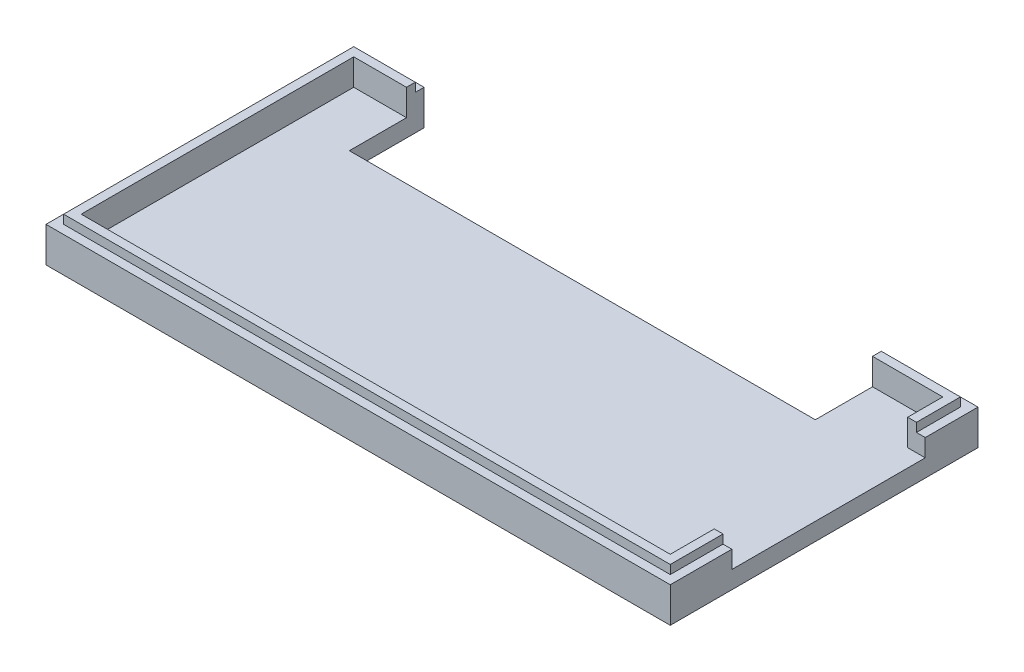
ISO-10303-21;
HEADER;
FILE_DESCRIPTION(('STEP AP214'),'2;1');
FILE_NAME('part.step','',(''),(''),'','','');
FILE_SCHEMA(('AUTOMOTIVE_DESIGN { 1 0 10303 214 1 1 1 1 }'));
ENDSEC;
DATA;
#1=APPLICATION_CONTEXT('core data for automotive mechanical design processes');
#2=APPLICATION_PROTOCOL_DEFINITION('international standard','automotive_design',2000,#1);
#3=PRODUCT_CONTEXT('',#1,'mechanical');
#4=PRODUCT('Part','Part','',(#3));
#5=PRODUCT_RELATED_PRODUCT_CATEGORY('part','',(#4));
#6=PRODUCT_DEFINITION_FORMATION('','',#4);
#7=PRODUCT_DEFINITION_CONTEXT('part definition',#1,'design');
#8=PRODUCT_DEFINITION('design','',#6,#7);
#9=PRODUCT_DEFINITION_SHAPE('','',#8);
#10=(LENGTH_UNIT() NAMED_UNIT(*) SI_UNIT(.MILLI.,.METRE.));
#11=(NAMED_UNIT(*) PLANE_ANGLE_UNIT() SI_UNIT($,.RADIAN.));
#12=(NAMED_UNIT(*) SI_UNIT($,.STERADIAN.) SOLID_ANGLE_UNIT());
#13=UNCERTAINTY_MEASURE_WITH_UNIT(LENGTH_MEASURE(1.E-05),#10,'distance_accuracy_value','');
#14=(GEOMETRIC_REPRESENTATION_CONTEXT(3) GLOBAL_UNCERTAINTY_ASSIGNED_CONTEXT((#13)) GLOBAL_UNIT_ASSIGNED_CONTEXT((#10,
#11,#12)) REPRESENTATION_CONTEXT('',''));
#15=CARTESIAN_POINT('',(0.,0.,0.));
#16=DIRECTION('',(0.,0.,1.));
#17=DIRECTION('',(1.,0.,0.));
#18=AXIS2_PLACEMENT_3D('',#15,#16,#17);
#19=CARTESIAN_POINT('',(0.,4.,0.));
#20=DIRECTION('',(0.,1.,0.));
#21=DIRECTION('',(0.,0.,1.));
#22=AXIS2_PLACEMENT_3D('',#19,#20,#21);
#23=PLANE('',#22);
#24=DIRECTION('',(0.,0.,1.));
#25=VECTOR('',#24,1.);
#26=CARTESIAN_POINT('',(6.00000000000002,4.,0.));
#27=LINE('',#26,#25);
#28=CARTESIAN_POINT('',(5.99999999999999,4.,-33.));
#29=VERTEX_POINT('',#28);
#30=CARTESIAN_POINT('',(5.99999999999999,4.,-32.));
#31=VERTEX_POINT('',#30);
#32=EDGE_CURVE('E347',#29,#31,#27,.T.);
#33=ORIENTED_EDGE('',*,*,#32,.F.);
#34=DIRECTION('',(-1.,0.,0.));
#35=VECTOR('',#34,1.);
#36=CARTESIAN_POINT('',(69.,4.,-33.));
#37=LINE('',#36,#35);
#38=CARTESIAN_POINT('',(-2.,4.,-33.));
#39=VERTEX_POINT('',#38);
#40=EDGE_CURVE('E306',#29,#39,#37,.T.);
#41=ORIENTED_EDGE('',*,*,#40,.T.);
#42=DIRECTION('',(0.,0.,1.));
#43=VECTOR('',#42,1.);
#44=CARTESIAN_POINT('',(-2.,4.,-33.));
#45=LINE('',#44,#43);
#46=CARTESIAN_POINT('',(-2.,4.,2.));
#47=VERTEX_POINT('',#46);
#48=EDGE_CURVE('E308',#39,#47,#45,.T.);
#49=ORIENTED_EDGE('',*,*,#48,.T.);
#50=DIRECTION('',(1.,0.,0.));
#51=VECTOR('',#50,1.);
#52=CARTESIAN_POINT('',(-2.,4.,2.));
#53=LINE('',#52,#51);
#54=CARTESIAN_POINT('',(69.,4.,2.));
#55=VERTEX_POINT('',#54);
#56=EDGE_CURVE('E299',#47,#55,#53,.T.);
#57=ORIENTED_EDGE('',*,*,#56,.T.);
#58=DIRECTION('',(0.,0.,-1.));
#59=VECTOR('',#58,1.);
#60=CARTESIAN_POINT('',(69.,4.,2.));
#61=LINE('',#60,#59);
#62=CARTESIAN_POINT('',(69.,4.,-5.));
#63=VERTEX_POINT('',#62);
#64=EDGE_CURVE('E303',#55,#63,#61,.T.);
#65=ORIENTED_EDGE('',*,*,#64,.T.);
#66=DIRECTION('',(1.,0.,0.));
#67=VECTOR('',#66,1.);
#68=CARTESIAN_POINT('',(0.,4.,-5.));
#69=LINE('',#68,#67);
#70=CARTESIAN_POINT('',(68.,4.,-5.));
#71=VERTEX_POINT('',#70);
#72=EDGE_CURVE('E374',#71,#63,#69,.T.);
#73=ORIENTED_EDGE('',*,*,#72,.F.);
#74=DIRECTION('',(0.,0.,-1.));
#75=VECTOR('',#74,1.);
#76=CARTESIAN_POINT('',(68.,4.,0.999999999999996));
#77=LINE('',#76,#75);
#78=CARTESIAN_POINT('',(68.,4.,0.999999999999996));
#79=VERTEX_POINT('',#78);
#80=EDGE_CURVE('E407',#79,#71,#77,.T.);
#81=ORIENTED_EDGE('',*,*,#80,.F.);
#82=DIRECTION('',(1.,0.,0.));
#83=VECTOR('',#82,1.);
#84=CARTESIAN_POINT('',(-1.,4.,1.));
#85=LINE('',#84,#83);
#86=CARTESIAN_POINT('',(-1.,4.,1.));
#87=VERTEX_POINT('',#86);
#88=EDGE_CURVE('E417',#87,#79,#85,.T.);
#89=ORIENTED_EDGE('',*,*,#88,.F.);
#90=DIRECTION('',(0.,0.,1.));
#91=VECTOR('',#90,1.);
#92=CARTESIAN_POINT('',(-1.,4.,-32.));
#93=LINE('',#92,#91);
#94=CARTESIAN_POINT('',(-1.,4.,-32.));
#95=VERTEX_POINT('',#94);
#96=EDGE_CURVE('E414',#95,#87,#93,.T.);
#97=ORIENTED_EDGE('',*,*,#96,.F.);
#98=DIRECTION('',(-1.,0.,0.));
#99=VECTOR('',#98,1.);
#100=CARTESIAN_POINT('',(68.,4.,-32.));
#101=LINE('',#100,#99);
#102=EDGE_CURVE('E410',#31,#95,#101,.T.);
#103=ORIENTED_EDGE('',*,*,#102,.F.);
#104=EDGE_LOOP('',(#33,#41,#49,#57,#65,#73,#81,#89,#97,#103));
#105=FACE_BOUND('',#104,.T.);
#106=ADVANCED_FACE('F33',(#105),#23,.T.);
#107=CARTESIAN_POINT('',(69.,2.,-33.));
#108=DIRECTION('',(0.,0.,1.));
#109=DIRECTION('',(1.,0.,0.));
#110=AXIS2_PLACEMENT_3D('',#107,#108,#109);
#111=PLANE('',#110);
#112=ORIENTED_EDGE('',*,*,#40,.F.);
#113=DIRECTION('',(0.,-1.,0.));
#114=VECTOR('',#113,1.);
#115=CARTESIAN_POINT('',(5.99999999999999,5.,-33.));
#116=LINE('',#115,#114);
#117=CARTESIAN_POINT('',(5.99999999999999,0.,-33.));
#118=VERTEX_POINT('',#117);
#119=EDGE_CURVE('E328',#29,#118,#116,.T.);
#120=ORIENTED_EDGE('',*,*,#119,.T.);
#121=DIRECTION('',(-1.,0.,0.));
#122=VECTOR('',#121,1.);
#123=CARTESIAN_POINT('',(69.,0.,-33.));
#124=LINE('',#123,#122);
#125=CARTESIAN_POINT('',(-2.,0.,-33.));
#126=VERTEX_POINT('',#125);
#127=EDGE_CURVE('E235',#118,#126,#124,.T.);
#128=ORIENTED_EDGE('',*,*,#127,.T.);
#129=DIRECTION('',(0.,-1.,0.));
#130=VECTOR('',#129,1.);
#131=CARTESIAN_POINT('',(-2.,2.,-33.));
#132=LINE('',#131,#130);
#133=EDGE_CURVE('E250',#39,#126,#132,.T.);
#134=ORIENTED_EDGE('',*,*,#133,.F.);
#135=EDGE_LOOP('',(#112,#120,#128,#134));
#136=FACE_BOUND('',#135,.T.);
#137=ADVANCED_FACE('F326',(#136),#111,.F.);
#138=CARTESIAN_POINT('',(0.,5.,0.));
#139=DIRECTION('',(0.,1.,0.));
#140=DIRECTION('',(0.,0.,1.));
#141=AXIS2_PLACEMENT_3D('',#138,#139,#140);
#142=PLANE('',#141);
#143=DIRECTION('',(0.,0.,-1.));
#144=VECTOR('',#143,1.);
#145=CARTESIAN_POINT('',(6.,5.,-24.5));
#146=LINE('',#145,#144);
#147=CARTESIAN_POINT('',(5.99999999999999,5.,-31.));
#148=VERTEX_POINT('',#147);
#149=CARTESIAN_POINT('',(5.99999999999999,5.,-32.));
#150=VERTEX_POINT('',#149);
#151=EDGE_CURVE('E218',#148,#150,#146,.T.);
#152=ORIENTED_EDGE('',*,*,#151,.T.);
#153=DIRECTION('',(-1.,0.,0.));
#154=VECTOR('',#153,1.);
#155=CARTESIAN_POINT('',(68.,5.,-32.));
#156=LINE('',#155,#154);
#157=CARTESIAN_POINT('',(-1.,5.,-32.));
#158=VERTEX_POINT('',#157);
#159=EDGE_CURVE('E397',#150,#158,#156,.T.);
#160=ORIENTED_EDGE('',*,*,#159,.T.);
#161=DIRECTION('',(0.,0.,1.));
#162=VECTOR('',#161,1.);
#163=CARTESIAN_POINT('',(-1.,5.,-32.));
#164=LINE('',#163,#162);
#165=CARTESIAN_POINT('',(-1.,5.,1.));
#166=VERTEX_POINT('',#165);
#167=EDGE_CURVE('E402',#158,#166,#164,.T.);
#168=ORIENTED_EDGE('',*,*,#167,.T.);
#169=DIRECTION('',(1.,0.,0.));
#170=VECTOR('',#169,1.);
#171=CARTESIAN_POINT('',(-1.,5.,1.));
#172=LINE('',#171,#170);
#173=CARTESIAN_POINT('',(68.,5.,0.999999999999996));
#174=VERTEX_POINT('',#173);
#175=EDGE_CURVE('E404',#166,#174,#172,.T.);
#176=ORIENTED_EDGE('',*,*,#175,.T.);
#177=DIRECTION('',(0.,0.,-1.));
#178=VECTOR('',#177,1.);
#179=CARTESIAN_POINT('',(68.,5.,0.999999999999996));
#180=LINE('',#179,#178);
#181=CARTESIAN_POINT('',(68.,5.,-5.));
#182=VERTEX_POINT('',#181);
#183=EDGE_CURVE('E394',#174,#182,#180,.T.);
#184=ORIENTED_EDGE('',*,*,#183,.T.);
#185=DIRECTION('',(-1.,0.,0.));
#186=VECTOR('',#185,1.);
#187=CARTESIAN_POINT('',(72.,5.,-5.));
#188=LINE('',#187,#186);
#189=CARTESIAN_POINT('',(67.,5.,-5.));
#190=VERTEX_POINT('',#189);
#191=EDGE_CURVE('E353',#182,#190,#188,.T.);
#192=ORIENTED_EDGE('',*,*,#191,.T.);
#193=DIRECTION('',(0.,0.,-1.));
#194=VECTOR('',#193,1.);
#195=CARTESIAN_POINT('',(67.,5.,0.));
#196=LINE('',#195,#194);
#197=CARTESIAN_POINT('',(67.,5.,0.));
#198=VERTEX_POINT('',#197);
#199=EDGE_CURVE('E380',#198,#190,#196,.T.);
#200=ORIENTED_EDGE('',*,*,#199,.F.);
#201=DIRECTION('',(1.,0.,0.));
#202=VECTOR('',#201,1.);
#203=CARTESIAN_POINT('',(0.,5.,0.));
#204=LINE('',#203,#202);
#205=CARTESIAN_POINT('',(0.,5.,0.));
#206=VERTEX_POINT('',#205);
#207=EDGE_CURVE('E390',#206,#198,#204,.T.);
#208=ORIENTED_EDGE('',*,*,#207,.F.);
#209=DIRECTION('',(0.,0.,1.));
#210=VECTOR('',#209,1.);
#211=CARTESIAN_POINT('',(0.,5.,-31.));
#212=LINE('',#211,#210);
#213=CARTESIAN_POINT('',(0.,5.,-31.));
#214=VERTEX_POINT('',#213);
#215=EDGE_CURVE('E387',#214,#206,#212,.T.);
#216=ORIENTED_EDGE('',*,*,#215,.F.);
#217=DIRECTION('',(-1.,0.,0.));
#218=VECTOR('',#217,1.);
#219=CARTESIAN_POINT('',(67.,5.,-31.));
#220=LINE('',#219,#218);
#221=EDGE_CURVE('E383',#148,#214,#220,.T.);
#222=ORIENTED_EDGE('',*,*,#221,.F.);
#223=EDGE_LOOP('',(#152,#160,#168,#176,#184,#192,#200,#208,#216,#222));
#224=FACE_BOUND('',#223,.T.);
#225=ADVANCED_FACE('F463',(#224),#142,.T.);
#226=CARTESIAN_POINT('',(68.,5.,-32.));
#227=DIRECTION('',(0.,0.,1.));
#228=DIRECTION('',(1.,0.,0.));
#229=AXIS2_PLACEMENT_3D('',#226,#227,#228);
#230=PLANE('',#229);
#231=ORIENTED_EDGE('',*,*,#159,.F.);
#232=DIRECTION('',(0.,-1.,0.));
#233=VECTOR('',#232,1.);
#234=CARTESIAN_POINT('',(5.99999999999999,5.,-32.));
#235=LINE('',#234,#233);
#236=EDGE_CURVE('E270',#150,#31,#235,.T.);
#237=ORIENTED_EDGE('',*,*,#236,.T.);
#238=ORIENTED_EDGE('',*,*,#102,.T.);
#239=DIRECTION('',(0.,-1.,0.));
#240=VECTOR('',#239,1.);
#241=CARTESIAN_POINT('',(-1.,5.,-32.));
#242=LINE('',#241,#240);
#243=EDGE_CURVE('E423',#158,#95,#242,.T.);
#244=ORIENTED_EDGE('',*,*,#243,.F.);
#245=EDGE_LOOP('',(#231,#237,#238,#244));
#246=FACE_BOUND('',#245,.T.);
#247=ADVANCED_FACE('F461',(#246),#230,.F.);
#248=CARTESIAN_POINT('',(67.,4.,-31.));
#249=DIRECTION('',(0.,0.,1.));
#250=DIRECTION('',(1.,0.,0.));
#251=AXIS2_PLACEMENT_3D('',#248,#249,#250);
#252=PLANE('',#251);
#253=DIRECTION('',(0.,-1.,0.));
#254=VECTOR('',#253,1.);
#255=CARTESIAN_POINT('',(5.99999999999999,4.,-31.));
#256=LINE('',#255,#254);
#257=CARTESIAN_POINT('',(5.99999999999999,2.,-31.));
#258=VERTEX_POINT('',#257);
#259=EDGE_CURVE('E41',#148,#258,#256,.T.);
#260=ORIENTED_EDGE('',*,*,#259,.F.);
#261=ORIENTED_EDGE('',*,*,#221,.T.);
#262=DIRECTION('',(0.,-1.,0.));
#263=VECTOR('',#262,1.);
#264=CARTESIAN_POINT('',(0.,4.,-31.));
#265=LINE('',#264,#263);
#266=CARTESIAN_POINT('',(0.,2.,-31.));
#267=VERTEX_POINT('',#266);
#268=EDGE_CURVE('E274',#214,#267,#265,.T.);
#269=ORIENTED_EDGE('',*,*,#268,.T.);
#270=DIRECTION('',(-1.,0.,0.));
#271=VECTOR('',#270,1.);
#272=CARTESIAN_POINT('',(67.,2.,-31.));
#273=LINE('',#272,#271);
#274=EDGE_CURVE('E268',#258,#267,#273,.T.);
#275=ORIENTED_EDGE('',*,*,#274,.F.);
#276=EDGE_LOOP('',(#260,#261,#269,#275));
#277=FACE_BOUND('',#276,.T.);
#278=ADVANCED_FACE('F272',(#277),#252,.T.);
#279=CARTESIAN_POINT('',(68.,5.,0.999999999999996));
#280=DIRECTION('',(-1.,0.,0.));
#281=DIRECTION('',(0.,0.,1.));
#282=AXIS2_PLACEMENT_3D('',#279,#280,#281);
#283=PLANE('',#282);
#284=ORIENTED_EDGE('',*,*,#80,.T.);
#285=DIRECTION('',(0.,1.,0.));
#286=VECTOR('',#285,1.);
#287=CARTESIAN_POINT('',(68.,5.,-5.));
#288=LINE('',#287,#286);
#289=EDGE_CURVE('E371',#71,#182,#288,.T.);
#290=ORIENTED_EDGE('',*,*,#289,.T.);
#291=ORIENTED_EDGE('',*,*,#183,.F.);
#292=DIRECTION('',(0.,-1.,0.));
#293=VECTOR('',#292,1.);
#294=CARTESIAN_POINT('',(68.,5.,0.999999999999996));
#295=LINE('',#294,#293);
#296=EDGE_CURVE('E406',#174,#79,#295,.T.);
#297=ORIENTED_EDGE('',*,*,#296,.T.);
#298=EDGE_LOOP('',(#284,#290,#291,#297));
#299=FACE_BOUND('',#298,.T.);
#300=ADVANCED_FACE('F454',(#299),#283,.F.);
#301=CARTESIAN_POINT('',(67.,4.,0.));
#302=DIRECTION('',(-1.,0.,0.));
#303=DIRECTION('',(0.,0.,1.));
#304=AXIS2_PLACEMENT_3D('',#301,#302,#303);
#305=PLANE('',#304);
#306=DIRECTION('',(0.,1.,0.));
#307=VECTOR('',#306,1.);
#308=CARTESIAN_POINT('',(67.,2.,-5.));
#309=LINE('',#308,#307);
#310=CARTESIAN_POINT('',(67.,2.,-5.));
#311=VERTEX_POINT('',#310);
#312=EDGE_CURVE('E351',#311,#190,#309,.T.);
#313=ORIENTED_EDGE('',*,*,#312,.F.);
#314=DIRECTION('',(0.,0.,-1.));
#315=VECTOR('',#314,1.);
#316=CARTESIAN_POINT('',(67.,2.,0.));
#317=LINE('',#316,#315);
#318=CARTESIAN_POINT('',(67.,2.,0.));
#319=VERTEX_POINT('',#318);
#320=EDGE_CURVE('E277',#319,#311,#317,.T.);
#321=ORIENTED_EDGE('',*,*,#320,.F.);
#322=DIRECTION('',(0.,-1.,0.));
#323=VECTOR('',#322,1.);
#324=CARTESIAN_POINT('',(67.,4.,0.));
#325=LINE('',#324,#323);
#326=EDGE_CURVE('E289',#198,#319,#325,.T.);
#327=ORIENTED_EDGE('',*,*,#326,.F.);
#328=ORIENTED_EDGE('',*,*,#199,.T.);
#329=EDGE_LOOP('',(#313,#321,#327,#328));
#330=FACE_BOUND('',#329,.T.);
#331=ADVANCED_FACE('F466',(#330),#305,.T.);
#332=DIRECTION('',(0.,0.,-1.));
#333=VECTOR('',#332,1.);
#334=CARTESIAN_POINT('',(59.,4.,0.));
#335=LINE('',#334,#333);
#336=CARTESIAN_POINT('',(59.,4.,-32.));
#337=VERTEX_POINT('',#336);
#338=CARTESIAN_POINT('',(59.,4.,-33.));
#339=VERTEX_POINT('',#338);
#340=EDGE_CURVE('E212',#337,#339,#335,.T.);
#341=ORIENTED_EDGE('',*,*,#340,.F.);
#342=CARTESIAN_POINT('',(68.,4.,-32.));
#343=VERTEX_POINT('',#342);
#344=EDGE_CURVE('E411',#343,#337,#101,.T.);
#345=ORIENTED_EDGE('',*,*,#344,.F.);
#346=CARTESIAN_POINT('',(68.,4.,-27.));
#347=VERTEX_POINT('',#346);
#348=EDGE_CURVE('E393',#347,#343,#77,.T.);
#349=ORIENTED_EDGE('',*,*,#348,.F.);
#350=DIRECTION('',(-1.,0.,0.));
#351=VECTOR('',#350,1.);
#352=CARTESIAN_POINT('',(0.,4.,-27.));
#353=LINE('',#352,#351);
#354=CARTESIAN_POINT('',(69.,4.,-27.));
#355=VERTEX_POINT('',#354);
#356=EDGE_CURVE('E364',#355,#347,#353,.T.);
#357=ORIENTED_EDGE('',*,*,#356,.F.);
#358=CARTESIAN_POINT('',(69.,4.,-33.));
#359=VERTEX_POINT('',#358);
#360=EDGE_CURVE('E302',#355,#359,#61,.T.);
#361=ORIENTED_EDGE('',*,*,#360,.T.);
#362=EDGE_CURVE('E307',#359,#339,#37,.T.);
#363=ORIENTED_EDGE('',*,*,#362,.T.);
#364=EDGE_LOOP('',(#341,#345,#349,#357,#361,#363));
#365=FACE_BOUND('',#364,.T.);
#366=ADVANCED_FACE('F447',(#365),#23,.T.);
#367=CARTESIAN_POINT('',(69.,2.,2.));
#368=DIRECTION('',(-1.,0.,0.));
#369=DIRECTION('',(0.,0.,1.));
#370=AXIS2_PLACEMENT_3D('',#367,#368,#369);
#371=PLANE('',#370);
#372=DIRECTION('',(0.,0.,1.));
#373=VECTOR('',#372,1.);
#374=CARTESIAN_POINT('',(69.,2.,2.));
#375=LINE('',#374,#373);
#376=CARTESIAN_POINT('',(69.,2.,-27.));
#377=VERTEX_POINT('',#376);
#378=CARTESIAN_POINT('',(69.,2.,-5.));
#379=VERTEX_POINT('',#378);
#380=EDGE_CURVE('E369',#377,#379,#375,.T.);
#381=ORIENTED_EDGE('',*,*,#380,.T.);
#382=DIRECTION('',(0.,1.,0.));
#383=VECTOR('',#382,1.);
#384=CARTESIAN_POINT('',(69.,2.,-5.));
#385=LINE('',#384,#383);
#386=EDGE_CURVE('E376',#379,#63,#385,.T.);
#387=ORIENTED_EDGE('',*,*,#386,.T.);
#388=ORIENTED_EDGE('',*,*,#64,.F.);
#389=DIRECTION('',(0.,-1.,0.));
#390=VECTOR('',#389,1.);
#391=CARTESIAN_POINT('',(69.,2.,2.));
#392=LINE('',#391,#390);
#393=CARTESIAN_POINT('',(69.,0.,2.));
#394=VERTEX_POINT('',#393);
#395=EDGE_CURVE('E244',#55,#394,#392,.T.);
#396=ORIENTED_EDGE('',*,*,#395,.T.);
#397=DIRECTION('',(0.,0.,-1.));
#398=VECTOR('',#397,1.);
#399=CARTESIAN_POINT('',(69.,0.,2.));
#400=LINE('',#399,#398);
#401=CARTESIAN_POINT('',(69.,0.,-33.));
#402=VERTEX_POINT('',#401);
#403=EDGE_CURVE('E239',#394,#402,#400,.T.);
#404=ORIENTED_EDGE('',*,*,#403,.T.);
#405=DIRECTION('',(0.,-1.,0.));
#406=VECTOR('',#405,1.);
#407=CARTESIAN_POINT('',(69.,2.,-33.));
#408=LINE('',#407,#406);
#409=EDGE_CURVE('E232',#359,#402,#408,.T.);
#410=ORIENTED_EDGE('',*,*,#409,.F.);
#411=ORIENTED_EDGE('',*,*,#360,.F.);
#412=DIRECTION('',(0.,-1.,0.));
#413=VECTOR('',#412,1.);
#414=CARTESIAN_POINT('',(69.,2.,-27.));
#415=LINE('',#414,#413);
#416=EDGE_CURVE('E366',#355,#377,#415,.T.);
#417=ORIENTED_EDGE('',*,*,#416,.T.);
#418=EDGE_LOOP('',(#381,#387,#388,#396,#404,#410,#411,#417));
#419=FACE_BOUND('',#418,.T.);
#420=ADVANCED_FACE('F35',(#419),#371,.F.);
#421=CARTESIAN_POINT('',(59.,0.,-33.));
#422=VERTEX_POINT('',#421);
#423=EDGE_CURVE('E224',#402,#422,#124,.T.);
#424=ORIENTED_EDGE('',*,*,#423,.T.);
#425=DIRECTION('',(0.,-1.,0.));
#426=VECTOR('',#425,1.);
#427=CARTESIAN_POINT('',(59.,5.,-33.));
#428=LINE('',#427,#426);
#429=EDGE_CURVE('E206',#339,#422,#428,.T.);
#430=ORIENTED_EDGE('',*,*,#429,.F.);
#431=ORIENTED_EDGE('',*,*,#362,.F.);
#432=ORIENTED_EDGE('',*,*,#409,.T.);
#433=EDGE_LOOP('',(#424,#430,#431,#432));
#434=FACE_BOUND('',#433,.T.);
#435=ADVANCED_FACE('F230',(#434),#111,.F.);
#436=CARTESIAN_POINT('',(-2.,2.,-33.));
#437=DIRECTION('',(1.,0.,0.));
#438=DIRECTION('',(0.,0.,-1.));
#439=AXIS2_PLACEMENT_3D('',#436,#437,#438);
#440=PLANE('',#439);
#441=DIRECTION('',(0.,0.,1.));
#442=VECTOR('',#441,1.);
#443=CARTESIAN_POINT('',(-2.,0.,-33.));
#444=LINE('',#443,#442);
#445=CARTESIAN_POINT('',(-2.,0.,2.));
#446=VERTEX_POINT('',#445);
#447=EDGE_CURVE('E234',#126,#446,#444,.T.);
#448=ORIENTED_EDGE('',*,*,#447,.T.);
#449=DIRECTION('',(0.,-1.,0.));
#450=VECTOR('',#449,1.);
#451=CARTESIAN_POINT('',(-2.,2.,2.));
#452=LINE('',#451,#450);
#453=EDGE_CURVE('E247',#47,#446,#452,.T.);
#454=ORIENTED_EDGE('',*,*,#453,.F.);
#455=ORIENTED_EDGE('',*,*,#48,.F.);
#456=ORIENTED_EDGE('',*,*,#133,.T.);
#457=EDGE_LOOP('',(#448,#454,#455,#456));
#458=FACE_BOUND('',#457,.T.);
#459=ADVANCED_FACE('F322',(#458),#440,.F.);
#460=CARTESIAN_POINT('',(-2.,2.,2.));
#461=DIRECTION('',(0.,0.,-1.));
#462=DIRECTION('',(-1.,0.,0.));
#463=AXIS2_PLACEMENT_3D('',#460,#461,#462);
#464=PLANE('',#463);
#465=DIRECTION('',(1.,0.,0.));
#466=VECTOR('',#465,1.);
#467=CARTESIAN_POINT('',(-2.,0.,2.));
#468=LINE('',#467,#466);
#469=EDGE_CURVE('E237',#446,#394,#468,.T.);
#470=ORIENTED_EDGE('',*,*,#469,.T.);
#471=ORIENTED_EDGE('',*,*,#395,.F.);
#472=ORIENTED_EDGE('',*,*,#56,.F.);
#473=ORIENTED_EDGE('',*,*,#453,.T.);
#474=EDGE_LOOP('',(#470,#471,#472,#473));
#475=FACE_BOUND('',#474,.T.);
#476=ADVANCED_FACE('F320',(#475),#464,.F.);
#477=CARTESIAN_POINT('',(0.,0.,0.));
#478=DIRECTION('',(0.,1.,0.));
#479=DIRECTION('',(0.,0.,1.));
#480=AXIS2_PLACEMENT_3D('',#477,#478,#479);
#481=PLANE('',#480);
#482=ORIENTED_EDGE('',*,*,#127,.F.);
#483=DIRECTION('',(0.,0.,-1.));
#484=VECTOR('',#483,1.);
#485=CARTESIAN_POINT('',(6.,0.,-24.5));
#486=LINE('',#485,#484);
#487=CARTESIAN_POINT('',(6.,0.,-24.5));
#488=VERTEX_POINT('',#487);
#489=EDGE_CURVE('E329',#488,#118,#486,.T.);
#490=ORIENTED_EDGE('',*,*,#489,.F.);
#491=DIRECTION('',(-1.,0.,0.));
#492=VECTOR('',#491,1.);
#493=CARTESIAN_POINT('',(59.,0.,-24.5));
#494=LINE('',#493,#492);
#495=CARTESIAN_POINT('',(59.,0.,-24.5));
#496=VERTEX_POINT('',#495);
#497=EDGE_CURVE('E228',#496,#488,#494,.T.);
#498=ORIENTED_EDGE('',*,*,#497,.F.);
#499=DIRECTION('',(0.,0.,1.));
#500=VECTOR('',#499,1.);
#501=CARTESIAN_POINT('',(59.,0.,-33.));
#502=LINE('',#501,#500);
#503=EDGE_CURVE('E209',#422,#496,#502,.T.);
#504=ORIENTED_EDGE('',*,*,#503,.F.);
#505=ORIENTED_EDGE('',*,*,#423,.F.);
#506=ORIENTED_EDGE('',*,*,#403,.F.);
#507=ORIENTED_EDGE('',*,*,#469,.F.);
#508=ORIENTED_EDGE('',*,*,#447,.F.);
#509=EDGE_LOOP('',(#482,#490,#498,#504,#505,#506,#507,#508));
#510=FACE_BOUND('',#509,.T.);
#511=ADVANCED_FACE('F222',(#510),#481,.F.);
#512=DIRECTION('',(0.,0.,1.));
#513=VECTOR('',#512,1.);
#514=CARTESIAN_POINT('',(59.,5.,-33.));
#515=LINE('',#514,#513);
#516=CARTESIAN_POINT('',(59.,5.,-32.));
#517=VERTEX_POINT('',#516);
#518=CARTESIAN_POINT('',(59.,5.,-31.));
#519=VERTEX_POINT('',#518);
#520=EDGE_CURVE('E330',#517,#519,#515,.T.);
#521=ORIENTED_EDGE('',*,*,#520,.T.);
#522=CARTESIAN_POINT('',(67.,5.,-31.));
#523=VERTEX_POINT('',#522);
#524=EDGE_CURVE('E384',#523,#519,#220,.T.);
#525=ORIENTED_EDGE('',*,*,#524,.F.);
#526=CARTESIAN_POINT('',(67.,5.,-27.));
#527=VERTEX_POINT('',#526);
#528=EDGE_CURVE('E379',#527,#523,#196,.T.);
#529=ORIENTED_EDGE('',*,*,#528,.F.);
#530=DIRECTION('',(-1.,0.,0.));
#531=VECTOR('',#530,1.);
#532=CARTESIAN_POINT('',(72.,5.,-27.));
#533=LINE('',#532,#531);
#534=CARTESIAN_POINT('',(68.,5.,-27.));
#535=VERTEX_POINT('',#534);
#536=EDGE_CURVE('E56',#535,#527,#533,.T.);
#537=ORIENTED_EDGE('',*,*,#536,.F.);
#538=CARTESIAN_POINT('',(68.,5.,-32.));
#539=VERTEX_POINT('',#538);
#540=EDGE_CURVE('E398',#535,#539,#180,.T.);
#541=ORIENTED_EDGE('',*,*,#540,.T.);
#542=EDGE_CURVE('E399',#539,#517,#156,.T.);
#543=ORIENTED_EDGE('',*,*,#542,.T.);
#544=EDGE_LOOP('',(#521,#525,#529,#537,#541,#543));
#545=FACE_BOUND('',#544,.T.);
#546=ADVANCED_FACE('F442',(#545),#142,.T.);
#547=ORIENTED_EDGE('',*,*,#540,.F.);
#548=DIRECTION('',(0.,-1.,0.));
#549=VECTOR('',#548,1.);
#550=CARTESIAN_POINT('',(68.,5.,-27.));
#551=LINE('',#550,#549);
#552=EDGE_CURVE('E356',#535,#347,#551,.T.);
#553=ORIENTED_EDGE('',*,*,#552,.T.);
#554=ORIENTED_EDGE('',*,*,#348,.T.);
#555=DIRECTION('',(0.,-1.,0.));
#556=VECTOR('',#555,1.);
#557=CARTESIAN_POINT('',(68.,5.,-32.));
#558=LINE('',#557,#556);
#559=EDGE_CURVE('E425',#539,#343,#558,.T.);
#560=ORIENTED_EDGE('',*,*,#559,.F.);
#561=EDGE_LOOP('',(#547,#553,#554,#560));
#562=FACE_BOUND('',#561,.T.);
#563=ADVANCED_FACE('F451',(#562),#283,.F.);
#564=ORIENTED_EDGE('',*,*,#344,.T.);
#565=DIRECTION('',(0.,1.,0.));
#566=VECTOR('',#565,1.);
#567=CARTESIAN_POINT('',(59.,5.,-32.));
#568=LINE('',#567,#566);
#569=EDGE_CURVE('E341',#337,#517,#568,.T.);
#570=ORIENTED_EDGE('',*,*,#569,.T.);
#571=ORIENTED_EDGE('',*,*,#542,.F.);
#572=ORIENTED_EDGE('',*,*,#559,.T.);
#573=EDGE_LOOP('',(#564,#570,#571,#572));
#574=FACE_BOUND('',#573,.T.);
#575=ADVANCED_FACE('F444',(#574),#230,.F.);
#576=CARTESIAN_POINT('',(-1.,5.,-32.));
#577=DIRECTION('',(1.,0.,0.));
#578=DIRECTION('',(0.,0.,-1.));
#579=AXIS2_PLACEMENT_3D('',#576,#577,#578);
#580=PLANE('',#579);
#581=ORIENTED_EDGE('',*,*,#96,.T.);
#582=DIRECTION('',(0.,-1.,0.));
#583=VECTOR('',#582,1.);
#584=CARTESIAN_POINT('',(-1.,5.,1.));
#585=LINE('',#584,#583);
#586=EDGE_CURVE('E421',#166,#87,#585,.T.);
#587=ORIENTED_EDGE('',*,*,#586,.F.);
#588=ORIENTED_EDGE('',*,*,#167,.F.);
#589=ORIENTED_EDGE('',*,*,#243,.T.);
#590=EDGE_LOOP('',(#581,#587,#588,#589));
#591=FACE_BOUND('',#590,.T.);
#592=ADVANCED_FACE('F459',(#591),#580,.F.);
#593=CARTESIAN_POINT('',(-1.,5.,1.));
#594=DIRECTION('',(0.,0.,-1.));
#595=DIRECTION('',(-1.,0.,0.));
#596=AXIS2_PLACEMENT_3D('',#593,#594,#595);
#597=PLANE('',#596);
#598=ORIENTED_EDGE('',*,*,#88,.T.);
#599=ORIENTED_EDGE('',*,*,#296,.F.);
#600=ORIENTED_EDGE('',*,*,#175,.F.);
#601=ORIENTED_EDGE('',*,*,#586,.T.);
#602=EDGE_LOOP('',(#598,#599,#600,#601));
#603=FACE_BOUND('',#602,.T.);
#604=ADVANCED_FACE('F514',(#603),#597,.F.);
#605=CARTESIAN_POINT('',(0.,2.,0.));
#606=DIRECTION('',(0.,1.,0.));
#607=DIRECTION('',(0.,0.,1.));
#608=AXIS2_PLACEMENT_3D('',#605,#606,#607);
#609=PLANE('',#608);
#610=DIRECTION('',(0.,0.,1.));
#611=VECTOR('',#610,1.);
#612=CARTESIAN_POINT('',(6.00000000000002,2.,0.));
#613=LINE('',#612,#611);
#614=CARTESIAN_POINT('',(6.,2.,-24.5));
#615=VERTEX_POINT('',#614);
#616=EDGE_CURVE('E259',#258,#615,#613,.T.);
#617=ORIENTED_EDGE('',*,*,#616,.F.);
#618=ORIENTED_EDGE('',*,*,#274,.T.);
#619=DIRECTION('',(0.,0.,1.));
#620=VECTOR('',#619,1.);
#621=CARTESIAN_POINT('',(0.,2.,-31.));
#622=LINE('',#621,#620);
#623=CARTESIAN_POINT('',(0.,2.,0.));
#624=VERTEX_POINT('',#623);
#625=EDGE_CURVE('E280',#267,#624,#622,.T.);
#626=ORIENTED_EDGE('',*,*,#625,.T.);
#627=DIRECTION('',(1.,0.,0.));
#628=VECTOR('',#627,1.);
#629=CARTESIAN_POINT('',(0.,2.,0.));
#630=LINE('',#629,#628);
#631=EDGE_CURVE('E287',#624,#319,#630,.T.);
#632=ORIENTED_EDGE('',*,*,#631,.T.);
#633=ORIENTED_EDGE('',*,*,#320,.T.);
#634=DIRECTION('',(-1.,0.,0.));
#635=VECTOR('',#634,1.);
#636=CARTESIAN_POINT('',(72.,2.,-5.));
#637=LINE('',#636,#635);
#638=EDGE_CURVE('E357',#379,#311,#637,.T.);
#639=ORIENTED_EDGE('',*,*,#638,.F.);
#640=ORIENTED_EDGE('',*,*,#380,.F.);
#641=DIRECTION('',(-1.,0.,0.));
#642=VECTOR('',#641,1.);
#643=CARTESIAN_POINT('',(72.,2.,-27.));
#644=LINE('',#643,#642);
#645=CARTESIAN_POINT('',(67.,2.,-27.));
#646=VERTEX_POINT('',#645);
#647=EDGE_CURVE('E359',#377,#646,#644,.T.);
#648=ORIENTED_EDGE('',*,*,#647,.T.);
#649=CARTESIAN_POINT('',(67.,2.,-31.));
#650=VERTEX_POINT('',#649);
#651=EDGE_CURVE('E282',#646,#650,#317,.T.);
#652=ORIENTED_EDGE('',*,*,#651,.T.);
#653=CARTESIAN_POINT('',(59.,2.,-31.));
#654=VERTEX_POINT('',#653);
#655=EDGE_CURVE('E276',#650,#654,#273,.T.);
#656=ORIENTED_EDGE('',*,*,#655,.T.);
#657=DIRECTION('',(0.,0.,-1.));
#658=VECTOR('',#657,1.);
#659=CARTESIAN_POINT('',(59.,2.,0.));
#660=LINE('',#659,#658);
#661=CARTESIAN_POINT('',(59.,2.,-24.5));
#662=VERTEX_POINT('',#661);
#663=EDGE_CURVE('E48',#662,#654,#660,.T.);
#664=ORIENTED_EDGE('',*,*,#663,.F.);
#665=DIRECTION('',(1.,0.,0.));
#666=VECTOR('',#665,1.);
#667=CARTESIAN_POINT('',(0.,2.,-24.5));
#668=LINE('',#667,#666);
#669=EDGE_CURVE('E11',#615,#662,#668,.T.);
#670=ORIENTED_EDGE('',*,*,#669,.F.);
#671=EDGE_LOOP('',(#617,#618,#626,#632,#633,#639,#640,#648,#652,#656,#664,#670));
#672=FACE_BOUND('',#671,.T.);
#673=ADVANCED_FACE('F267',(#672),#609,.T.);
#674=CARTESIAN_POINT('',(0.,4.,0.));
#675=DIRECTION('',(0.,0.,-1.));
#676=DIRECTION('',(-1.,0.,0.));
#677=AXIS2_PLACEMENT_3D('',#674,#675,#676);
#678=PLANE('',#677);
#679=ORIENTED_EDGE('',*,*,#631,.F.);
#680=DIRECTION('',(0.,-1.,0.));
#681=VECTOR('',#680,1.);
#682=CARTESIAN_POINT('',(0.,4.,0.));
#683=LINE('',#682,#681);
#684=EDGE_CURVE('E292',#206,#624,#683,.T.);
#685=ORIENTED_EDGE('',*,*,#684,.F.);
#686=ORIENTED_EDGE('',*,*,#207,.T.);
#687=ORIENTED_EDGE('',*,*,#326,.T.);
#688=EDGE_LOOP('',(#679,#685,#686,#687));
#689=FACE_BOUND('',#688,.T.);
#690=ADVANCED_FACE('F498',(#689),#678,.T.);
#691=CARTESIAN_POINT('',(0.,4.,-31.));
#692=DIRECTION('',(1.,0.,0.));
#693=DIRECTION('',(0.,0.,-1.));
#694=AXIS2_PLACEMENT_3D('',#691,#692,#693);
#695=PLANE('',#694);
#696=ORIENTED_EDGE('',*,*,#625,.F.);
#697=ORIENTED_EDGE('',*,*,#268,.F.);
#698=ORIENTED_EDGE('',*,*,#215,.T.);
#699=ORIENTED_EDGE('',*,*,#684,.T.);
#700=EDGE_LOOP('',(#696,#697,#698,#699));
#701=FACE_BOUND('',#700,.T.);
#702=ADVANCED_FACE('F494',(#701),#695,.T.);
#703=DIRECTION('',(0.,1.,0.));
#704=VECTOR('',#703,1.);
#705=CARTESIAN_POINT('',(59.,4.,-31.));
#706=LINE('',#705,#704);
#707=EDGE_CURVE('E254',#654,#519,#706,.T.);
#708=ORIENTED_EDGE('',*,*,#707,.F.);
#709=ORIENTED_EDGE('',*,*,#655,.F.);
#710=DIRECTION('',(0.,-1.,0.));
#711=VECTOR('',#710,1.);
#712=CARTESIAN_POINT('',(67.,4.,-31.));
#713=LINE('',#712,#711);
#714=EDGE_CURVE('E296',#523,#650,#713,.T.);
#715=ORIENTED_EDGE('',*,*,#714,.F.);
#716=ORIENTED_EDGE('',*,*,#524,.T.);
#717=EDGE_LOOP('',(#708,#709,#715,#716));
#718=FACE_BOUND('',#717,.T.);
#719=ADVANCED_FACE('F437',(#718),#252,.T.);
#720=DIRECTION('',(0.,-1.,0.));
#721=VECTOR('',#720,1.);
#722=CARTESIAN_POINT('',(67.,5.,-27.));
#723=LINE('',#722,#721);
#724=EDGE_CURVE('E349',#527,#646,#723,.T.);
#725=ORIENTED_EDGE('',*,*,#724,.F.);
#726=ORIENTED_EDGE('',*,*,#528,.T.);
#727=ORIENTED_EDGE('',*,*,#714,.T.);
#728=ORIENTED_EDGE('',*,*,#651,.F.);
#729=EDGE_LOOP('',(#725,#726,#727,#728));
#730=FACE_BOUND('',#729,.T.);
#731=ADVANCED_FACE('F439',(#730),#305,.T.);
#732=CARTESIAN_POINT('',(72.,2.,-5.));
#733=DIRECTION('',(0.,0.,1.));
#734=DIRECTION('',(1.,0.,0.));
#735=AXIS2_PLACEMENT_3D('',#732,#733,#734);
#736=PLANE('',#735);
#737=ORIENTED_EDGE('',*,*,#638,.T.);
#738=ORIENTED_EDGE('',*,*,#312,.T.);
#739=ORIENTED_EDGE('',*,*,#191,.F.);
#740=ORIENTED_EDGE('',*,*,#289,.F.);
#741=ORIENTED_EDGE('',*,*,#72,.T.);
#742=ORIENTED_EDGE('',*,*,#386,.F.);
#743=EDGE_LOOP('',(#737,#738,#739,#740,#741,#742));
#744=FACE_BOUND('',#743,.T.);
#745=ADVANCED_FACE('F487',(#744),#736,.F.);
#746=CARTESIAN_POINT('',(72.,5.,-27.));
#747=DIRECTION('',(0.,0.,-1.));
#748=DIRECTION('',(-1.,0.,0.));
#749=AXIS2_PLACEMENT_3D('',#746,#747,#748);
#750=PLANE('',#749);
#751=ORIENTED_EDGE('',*,*,#356,.T.);
#752=ORIENTED_EDGE('',*,*,#552,.F.);
#753=ORIENTED_EDGE('',*,*,#536,.T.);
#754=ORIENTED_EDGE('',*,*,#724,.T.);
#755=ORIENTED_EDGE('',*,*,#647,.F.);
#756=ORIENTED_EDGE('',*,*,#416,.F.);
#757=EDGE_LOOP('',(#751,#752,#753,#754,#755,#756));
#758=FACE_BOUND('',#757,.T.);
#759=ADVANCED_FACE('F449',(#758),#750,.F.);
#760=CARTESIAN_POINT('',(6.,5.,-24.5));
#761=DIRECTION('',(-1.,0.,0.));
#762=DIRECTION('',(0.,0.,1.));
#763=AXIS2_PLACEMENT_3D('',#760,#761,#762);
#764=PLANE('',#763);
#765=ORIENTED_EDGE('',*,*,#32,.T.);
#766=ORIENTED_EDGE('',*,*,#236,.F.);
#767=ORIENTED_EDGE('',*,*,#151,.F.);
#768=ORIENTED_EDGE('',*,*,#259,.T.);
#769=ORIENTED_EDGE('',*,*,#616,.T.);
#770=DIRECTION('',(0.,-1.,0.));
#771=VECTOR('',#770,1.);
#772=CARTESIAN_POINT('',(6.,5.,-24.5));
#773=LINE('',#772,#771);
#774=EDGE_CURVE('E337',#615,#488,#773,.T.);
#775=ORIENTED_EDGE('',*,*,#774,.T.);
#776=ORIENTED_EDGE('',*,*,#489,.T.);
#777=ORIENTED_EDGE('',*,*,#119,.F.);
#778=EDGE_LOOP('',(#765,#766,#767,#768,#769,#775,#776,#777));
#779=FACE_BOUND('',#778,.T.);
#780=ADVANCED_FACE('F258',(#779),#764,.F.);
#781=CARTESIAN_POINT('',(59.,5.,-24.5));
#782=DIRECTION('',(0.,0.,1.));
#783=DIRECTION('',(1.,0.,0.));
#784=AXIS2_PLACEMENT_3D('',#781,#782,#783);
#785=PLANE('',#784);
#786=ORIENTED_EDGE('',*,*,#669,.T.);
#787=DIRECTION('',(0.,-1.,0.));
#788=VECTOR('',#787,1.);
#789=CARTESIAN_POINT('',(59.,5.,-24.5));
#790=LINE('',#789,#788);
#791=EDGE_CURVE('E217',#662,#496,#790,.T.);
#792=ORIENTED_EDGE('',*,*,#791,.T.);
#793=ORIENTED_EDGE('',*,*,#497,.T.);
#794=ORIENTED_EDGE('',*,*,#774,.F.);
#795=EDGE_LOOP('',(#786,#792,#793,#794));
#796=FACE_BOUND('',#795,.T.);
#797=ADVANCED_FACE('F523',(#796),#785,.F.);
#798=CARTESIAN_POINT('',(59.,5.,-33.));
#799=DIRECTION('',(1.,0.,0.));
#800=DIRECTION('',(0.,0.,-1.));
#801=AXIS2_PLACEMENT_3D('',#798,#799,#800);
#802=PLANE('',#801);
#803=ORIENTED_EDGE('',*,*,#340,.T.);
#804=ORIENTED_EDGE('',*,*,#429,.T.);
#805=ORIENTED_EDGE('',*,*,#503,.T.);
#806=ORIENTED_EDGE('',*,*,#791,.F.);
#807=ORIENTED_EDGE('',*,*,#663,.T.);
#808=ORIENTED_EDGE('',*,*,#707,.T.);
#809=ORIENTED_EDGE('',*,*,#520,.F.);
#810=ORIENTED_EDGE('',*,*,#569,.F.);
#811=EDGE_LOOP('',(#803,#804,#805,#806,#807,#808,#809,#810));
#812=FACE_BOUND('',#811,.T.);
#813=ADVANCED_FACE('F208',(#812),#802,.F.);
#814=CLOSED_SHELL('',(#106,#137,#225,#247,#278,#300,#331,#366,#420,#435,#459,#476,#511,#546,
#563,#575,#592,#604,#673,#690,#702,#719,#731,#745,#759,#780,#797,#813));
#815=MANIFOLD_SOLID_BREP('B2',#814);
#816=ADVANCED_BREP_SHAPE_REPRESENTATION('',(#18,#815),#14);
#817=SHAPE_DEFINITION_REPRESENTATION(#9,#816);
ENDSEC;
END-ISO-10303-21;
